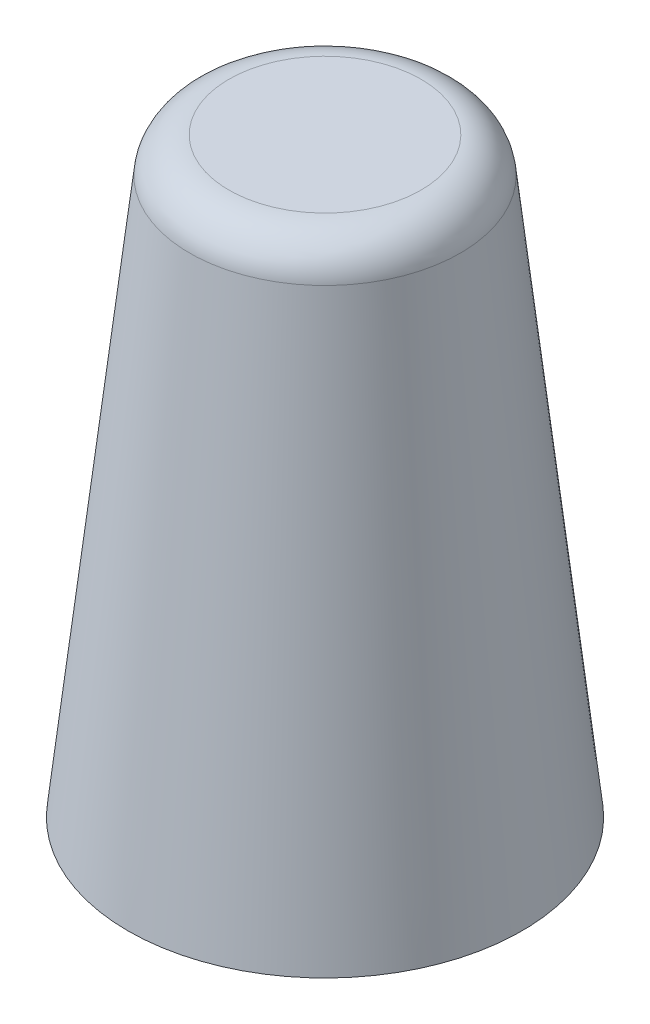
ISO-10303-21;
HEADER;
FILE_DESCRIPTION(('STEP AP214'),'2;1');
FILE_NAME('part.step','',(''),(''),'','','');
FILE_SCHEMA(('AUTOMOTIVE_DESIGN { 1 0 10303 214 1 1 1 1 }'));
ENDSEC;
DATA;
#1=APPLICATION_CONTEXT('core data for automotive mechanical design processes');
#2=APPLICATION_PROTOCOL_DEFINITION('international standard','automotive_design',2000,#1);
#3=PRODUCT_CONTEXT('',#1,'mechanical');
#4=PRODUCT('Part','Part','',(#3));
#5=PRODUCT_RELATED_PRODUCT_CATEGORY('part','',(#4));
#6=PRODUCT_DEFINITION_FORMATION('','',#4);
#7=PRODUCT_DEFINITION_CONTEXT('part definition',#1,'design');
#8=PRODUCT_DEFINITION('design','',#6,#7);
#9=PRODUCT_DEFINITION_SHAPE('','',#8);
#10=(LENGTH_UNIT() NAMED_UNIT(*) SI_UNIT(.MILLI.,.METRE.));
#11=(NAMED_UNIT(*) PLANE_ANGLE_UNIT() SI_UNIT($,.RADIAN.));
#12=(NAMED_UNIT(*) SI_UNIT($,.STERADIAN.) SOLID_ANGLE_UNIT());
#13=UNCERTAINTY_MEASURE_WITH_UNIT(LENGTH_MEASURE(1.E-05),#10,'distance_accuracy_value','');
#14=(GEOMETRIC_REPRESENTATION_CONTEXT(3) GLOBAL_UNCERTAINTY_ASSIGNED_CONTEXT((#13)) GLOBAL_UNIT_ASSIGNED_CONTEXT((#10,
#11,#12)) REPRESENTATION_CONTEXT('',''));
#15=CARTESIAN_POINT('',(0.,0.,0.));
#16=DIRECTION('',(0.,0.,1.));
#17=DIRECTION('',(1.,0.,0.));
#18=AXIS2_PLACEMENT_3D('',#15,#16,#17);
#19=CARTESIAN_POINT('',(15.,0.,0.));
#20=DIRECTION('',(0.,-1.,0.));
#21=DIRECTION('',(0.,0.,-1.));
#22=AXIS2_PLACEMENT_3D('',#19,#20,#21);
#23=PLANE('',#22);
#24=CARTESIAN_POINT('',(0.,0.,0.));
#25=DIRECTION('',(0.,-1.,0.));
#26=DIRECTION('',(0.,0.,-1.));
#27=AXIS2_PLACEMENT_3D('',#24,#25,#26);
#28=CIRCLE('',#27,15.);
#29=CARTESIAN_POINT('',(0.,0.,-15.));
#30=VERTEX_POINT('',#29);
#31=EDGE_CURVE('E10',#30,#30,#28,.T.);
#32=ORIENTED_EDGE('',*,*,#31,.T.);
#33=EDGE_LOOP('',(#32));
#34=FACE_BOUND('',#33,.T.);
#35=ADVANCED_FACE('F31',(#34),#23,.T.);
#36=CARTESIAN_POINT('',(0.,0.,0.));
#37=DIRECTION('',(0.,-1.,0.));
#38=DIRECTION('',(0.,0.,-1.));
#39=AXIS2_PLACEMENT_3D('',#36,#37,#38);
#40=CONICAL_SURFACE('',#39,15.,0.110657221173896);
#41=CARTESIAN_POINT('',(0.,42.3312945782245,0.));
#42=DIRECTION('',(0.,-1.,0.));
#43=DIRECTION('',(0.,0.,-1.));
#44=AXIS2_PLACEMENT_3D('',#41,#42,#43);
#45=CIRCLE('',#44,10.2965228246417);
#46=CARTESIAN_POINT('',(0.,42.3312945782245,-10.2965228246417));
#47=VERTEX_POINT('',#46);
#48=EDGE_CURVE('E37',#47,#47,#45,.T.);
#49=ORIENTED_EDGE('',*,*,#48,.T.);
#50=EDGE_LOOP('',(#49));
#51=FACE_BOUND('',#50,.T.);
#52=ORIENTED_EDGE('',*,*,#31,.F.);
#53=EDGE_LOOP('',(#52));
#54=FACE_BOUND('',#53,.T.);
#55=ADVANCED_FACE('F57',(#51,#54),#40,.T.);
#56=CARTESIAN_POINT('',(0.,42.,0.));
#57=DIRECTION('',(0.,-1.,0.));
#58=DIRECTION('',(0.,0.,-1.));
#59=AXIS2_PLACEMENT_3D('',#56,#57,#58);
#60=TOROIDAL_SURFACE('',#59,7.31487162062086,3.);
#61=CARTESIAN_POINT('',(0.,45.,0.));
#62=DIRECTION('',(0.,-1.,0.));
#63=DIRECTION('',(0.,0.,-1.));
#64=AXIS2_PLACEMENT_3D('',#61,#62,#63);
#65=CIRCLE('',#64,7.31487162062084);
#66=CARTESIAN_POINT('',(0.,45.,-7.31487162062084));
#67=VERTEX_POINT('',#66);
#68=EDGE_CURVE('E41',#67,#67,#65,.T.);
#69=ORIENTED_EDGE('',*,*,#68,.T.);
#70=EDGE_LOOP('',(#69));
#71=FACE_BOUND('',#70,.T.);
#72=ORIENTED_EDGE('',*,*,#48,.F.);
#73=EDGE_LOOP('',(#72));
#74=FACE_BOUND('',#73,.T.);
#75=ADVANCED_FACE('F48',(#71,#74),#60,.T.);
#76=CARTESIAN_POINT('',(0.,45.,0.));
#77=DIRECTION('',(0.,1.,0.));
#78=DIRECTION('',(0.,0.,1.));
#79=AXIS2_PLACEMENT_3D('',#76,#77,#78);
#80=PLANE('',#79);
#81=ORIENTED_EDGE('',*,*,#68,.F.);
#82=EDGE_LOOP('',(#81));
#83=FACE_BOUND('',#82,.T.);
#84=ADVANCED_FACE('F51',(#83),#80,.T.);
#85=CLOSED_SHELL('',(#35,#55,#75,#84));
#86=MANIFOLD_SOLID_BREP('B2',#85);
#87=ADVANCED_BREP_SHAPE_REPRESENTATION('',(#18,#86),#14);
#88=SHAPE_DEFINITION_REPRESENTATION(#9,#87);
ENDSEC;
END-ISO-10303-21;
